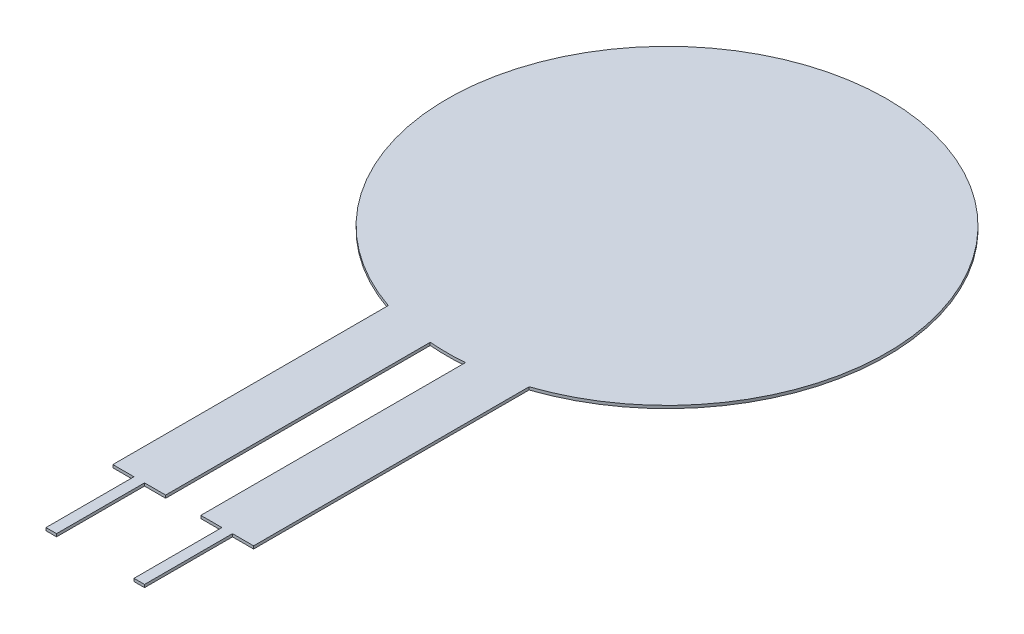
ISO-10303-21;
HEADER;
FILE_DESCRIPTION(('STEP AP214'),'2;1');
FILE_NAME('part.step','',(''),(''),'','','');
FILE_SCHEMA(('AUTOMOTIVE_DESIGN { 1 0 10303 214 1 1 1 1 }'));
ENDSEC;
DATA;
#1=APPLICATION_CONTEXT('core data for automotive mechanical design processes');
#2=APPLICATION_PROTOCOL_DEFINITION('international standard','automotive_design',2000,#1);
#3=PRODUCT_CONTEXT('',#1,'mechanical');
#4=PRODUCT('Part','Part','',(#3));
#5=PRODUCT_RELATED_PRODUCT_CATEGORY('part','',(#4));
#6=PRODUCT_DEFINITION_FORMATION('','',#4);
#7=PRODUCT_DEFINITION_CONTEXT('part definition',#1,'design');
#8=PRODUCT_DEFINITION('design','',#6,#7);
#9=PRODUCT_DEFINITION_SHAPE('','',#8);
#10=(LENGTH_UNIT() NAMED_UNIT(*) SI_UNIT(.MILLI.,.METRE.));
#11=(NAMED_UNIT(*) PLANE_ANGLE_UNIT() SI_UNIT($,.RADIAN.));
#12=(NAMED_UNIT(*) SI_UNIT($,.STERADIAN.) SOLID_ANGLE_UNIT());
#13=UNCERTAINTY_MEASURE_WITH_UNIT(LENGTH_MEASURE(1.E-05),#10,'distance_accuracy_value','');
#14=(GEOMETRIC_REPRESENTATION_CONTEXT(3) GLOBAL_UNCERTAINTY_ASSIGNED_CONTEXT((#13)) GLOBAL_UNIT_ASSIGNED_CONTEXT((#10,
#11,#12)) REPRESENTATION_CONTEXT('',''));
#15=CARTESIAN_POINT('',(0.,0.,0.));
#16=DIRECTION('',(0.,0.,1.));
#17=DIRECTION('',(1.,0.,0.));
#18=AXIS2_PLACEMENT_3D('',#15,#16,#17);
#19=CARTESIAN_POINT('',(0.,0.2032,0.));
#20=DIRECTION('',(0.,-1.,0.));
#21=DIRECTION('',(0.,0.,-1.));
#22=AXIS2_PLACEMENT_3D('',#19,#20,#21);
#23=CYLINDRICAL_SURFACE('',#22,15.875);
#24=CARTESIAN_POINT('',(0.,0.,0.));
#25=DIRECTION('',(0.,1.,0.));
#26=DIRECTION('',(0.,0.,1.));
#27=AXIS2_PLACEMENT_3D('',#24,#25,#26);
#28=CIRCLE('',#27,15.875);
#29=CARTESIAN_POINT('',(5.08,0.,15.0402534885553));
#30=VERTEX_POINT('',#29);
#31=CARTESIAN_POINT('',(-5.08000000000001,0.,15.0402534885553));
#32=VERTEX_POINT('',#31);
#33=EDGE_CURVE('E191',#30,#32,#28,.T.);
#34=ORIENTED_EDGE('',*,*,#33,.T.);
#35=DIRECTION('',(0.,-1.,0.));
#36=VECTOR('',#35,1.);
#37=CARTESIAN_POINT('',(-5.08000000000001,0.2032,15.0402534885553));
#38=LINE('',#37,#36);
#39=CARTESIAN_POINT('',(-5.08000000000001,0.2032,15.0402534885553));
#40=VERTEX_POINT('',#39);
#41=EDGE_CURVE('E53',#40,#32,#38,.T.);
#42=ORIENTED_EDGE('',*,*,#41,.F.);
#43=CARTESIAN_POINT('',(0.,0.2032,0.));
#44=DIRECTION('',(0.,1.,0.));
#45=DIRECTION('',(0.,0.,1.));
#46=AXIS2_PLACEMENT_3D('',#43,#44,#45);
#47=CIRCLE('',#46,15.875);
#48=CARTESIAN_POINT('',(5.08,0.2032,15.0402534885553));
#49=VERTEX_POINT('',#48);
#50=EDGE_CURVE('E125',#49,#40,#47,.T.);
#51=ORIENTED_EDGE('',*,*,#50,.F.);
#52=DIRECTION('',(0.,-1.,0.));
#53=VECTOR('',#52,1.);
#54=CARTESIAN_POINT('',(5.08,0.2032,15.0402534885553));
#55=LINE('',#54,#53);
#56=EDGE_CURVE('E11',#49,#30,#55,.T.);
#57=ORIENTED_EDGE('',*,*,#56,.T.);
#58=EDGE_LOOP('',(#34,#42,#51,#57));
#59=FACE_BOUND('',#58,.T.);
#60=ADVANCED_FACE('F45',(#59),#23,.T.);
#61=CARTESIAN_POINT('',(-5.08,0.2032,15.2942534885553));
#62=DIRECTION('',(1.,0.,0.));
#63=DIRECTION('',(0.,0.,-1.));
#64=AXIS2_PLACEMENT_3D('',#61,#62,#63);
#65=PLANE('',#64);
#66=DIRECTION('',(0.,0.,1.));
#67=VECTOR('',#66,1.);
#68=CARTESIAN_POINT('',(-5.08,0.,15.2942534885553));
#69=LINE('',#68,#67);
#70=CARTESIAN_POINT('',(-5.08,0.,34.925));
#71=VERTEX_POINT('',#70);
#72=EDGE_CURVE('E194',#32,#71,#69,.T.);
#73=ORIENTED_EDGE('',*,*,#72,.T.);
#74=DIRECTION('',(0.,-1.,0.));
#75=VECTOR('',#74,1.);
#76=CARTESIAN_POINT('',(-5.08,0.2032,34.925));
#77=LINE('',#76,#75);
#78=CARTESIAN_POINT('',(-5.08,0.2032,34.925));
#79=VERTEX_POINT('',#78);
#80=EDGE_CURVE('E255',#79,#71,#77,.T.);
#81=ORIENTED_EDGE('',*,*,#80,.F.);
#82=DIRECTION('',(0.,0.,-1.));
#83=VECTOR('',#82,1.);
#84=CARTESIAN_POINT('',(-5.08,0.2032,15.2942534885553));
#85=LINE('',#84,#83);
#86=EDGE_CURVE('E261',#79,#40,#85,.T.);
#87=ORIENTED_EDGE('',*,*,#86,.T.);
#88=ORIENTED_EDGE('',*,*,#41,.T.);
#89=EDGE_LOOP('',(#73,#81,#87,#88));
#90=FACE_BOUND('',#89,.T.);
#91=ADVANCED_FACE('F259',(#90),#65,.F.);
#92=CARTESIAN_POINT('',(-3.55599999999999,0.2032,34.925));
#93=DIRECTION('',(0.,0.,1.));
#94=DIRECTION('',(1.,0.,0.));
#95=AXIS2_PLACEMENT_3D('',#92,#93,#94);
#96=PLANE('',#95);
#97=DIRECTION('',(-1.,0.,0.));
#98=VECTOR('',#97,1.);
#99=CARTESIAN_POINT('',(-3.55599999999999,0.,34.925));
#100=LINE('',#99,#98);
#101=CARTESIAN_POINT('',(-3.55599999999999,0.,34.925));
#102=VERTEX_POINT('',#101);
#103=EDGE_CURVE('E197',#102,#71,#100,.T.);
#104=ORIENTED_EDGE('',*,*,#103,.F.);
#105=DIRECTION('',(0.,-1.,0.));
#106=VECTOR('',#105,1.);
#107=CARTESIAN_POINT('',(-3.55599999999999,0.2032,34.925));
#108=LINE('',#107,#106);
#109=CARTESIAN_POINT('',(-3.55599999999999,0.2032,34.925));
#110=VERTEX_POINT('',#109);
#111=EDGE_CURVE('E253',#110,#102,#108,.T.);
#112=ORIENTED_EDGE('',*,*,#111,.F.);
#113=DIRECTION('',(-1.,0.,0.));
#114=VECTOR('',#113,1.);
#115=CARTESIAN_POINT('',(-3.55599999999999,0.2032,34.925));
#116=LINE('',#115,#114);
#117=EDGE_CURVE('E273',#110,#79,#116,.T.);
#118=ORIENTED_EDGE('',*,*,#117,.T.);
#119=ORIENTED_EDGE('',*,*,#80,.T.);
#120=EDGE_LOOP('',(#104,#112,#118,#119));
#121=FACE_BOUND('',#120,.T.);
#122=ADVANCED_FACE('F269',(#121),#96,.T.);
#123=CARTESIAN_POINT('',(-3.55599999999999,0.2032,34.925));
#124=DIRECTION('',(1.,0.,0.));
#125=DIRECTION('',(0.,0.,-1.));
#126=AXIS2_PLACEMENT_3D('',#123,#124,#125);
#127=PLANE('',#126);
#128=DIRECTION('',(0.,0.,1.));
#129=VECTOR('',#128,1.);
#130=CARTESIAN_POINT('',(-3.55599999999999,0.,34.925));
#131=LINE('',#130,#129);
#132=CARTESIAN_POINT('',(-3.55599999999999,0.,41.275));
#133=VERTEX_POINT('',#132);
#134=EDGE_CURVE('E200',#102,#133,#131,.T.);
#135=ORIENTED_EDGE('',*,*,#134,.T.);
#136=DIRECTION('',(0.,-1.,0.));
#137=VECTOR('',#136,1.);
#138=CARTESIAN_POINT('',(-3.55599999999999,0.2032,41.275));
#139=LINE('',#138,#137);
#140=CARTESIAN_POINT('',(-3.55599999999999,0.2032,41.275));
#141=VERTEX_POINT('',#140);
#142=EDGE_CURVE('E250',#141,#133,#139,.T.);
#143=ORIENTED_EDGE('',*,*,#142,.F.);
#144=DIRECTION('',(0.,0.,1.));
#145=VECTOR('',#144,1.);
#146=CARTESIAN_POINT('',(-3.55599999999999,0.2032,34.925));
#147=LINE('',#146,#145);
#148=EDGE_CURVE('E274',#110,#141,#147,.T.);
#149=ORIENTED_EDGE('',*,*,#148,.F.);
#150=ORIENTED_EDGE('',*,*,#111,.T.);
#151=EDGE_LOOP('',(#135,#143,#149,#150));
#152=FACE_BOUND('',#151,.T.);
#153=ADVANCED_FACE('F325',(#152),#127,.F.);
#154=CARTESIAN_POINT('',(-3.55599999999999,0.2032,41.275));
#155=DIRECTION('',(0.,0.,-1.));
#156=DIRECTION('',(-1.,0.,0.));
#157=AXIS2_PLACEMENT_3D('',#154,#155,#156);
#158=PLANE('',#157);
#159=DIRECTION('',(1.,0.,0.));
#160=VECTOR('',#159,1.);
#161=CARTESIAN_POINT('',(-3.55599999999999,0.,41.275));
#162=LINE('',#161,#160);
#163=CARTESIAN_POINT('',(-2.79399999999999,0.,41.275));
#164=VERTEX_POINT('',#163);
#165=EDGE_CURVE('E202',#133,#164,#162,.T.);
#166=ORIENTED_EDGE('',*,*,#165,.T.);
#167=DIRECTION('',(0.,-1.,0.));
#168=VECTOR('',#167,1.);
#169=CARTESIAN_POINT('',(-2.79399999999999,0.2032,41.275));
#170=LINE('',#169,#168);
#171=CARTESIAN_POINT('',(-2.79399999999999,0.2032,41.275));
#172=VERTEX_POINT('',#171);
#173=EDGE_CURVE('E248',#172,#164,#170,.T.);
#174=ORIENTED_EDGE('',*,*,#173,.F.);
#175=DIRECTION('',(1.,0.,0.));
#176=VECTOR('',#175,1.);
#177=CARTESIAN_POINT('',(-3.55599999999999,0.2032,41.275));
#178=LINE('',#177,#176);
#179=EDGE_CURVE('E276',#141,#172,#178,.T.);
#180=ORIENTED_EDGE('',*,*,#179,.F.);
#181=ORIENTED_EDGE('',*,*,#142,.T.);
#182=EDGE_LOOP('',(#166,#174,#180,#181));
#183=FACE_BOUND('',#182,.T.);
#184=ADVANCED_FACE('F330',(#183),#158,.F.);
#185=CARTESIAN_POINT('',(-2.79399999999999,0.2032,34.925));
#186=DIRECTION('',(1.,0.,0.));
#187=DIRECTION('',(0.,0.,-1.));
#188=AXIS2_PLACEMENT_3D('',#185,#186,#187);
#189=PLANE('',#188);
#190=DIRECTION('',(0.,0.,1.));
#191=VECTOR('',#190,1.);
#192=CARTESIAN_POINT('',(-2.79399999999999,0.,34.925));
#193=LINE('',#192,#191);
#194=CARTESIAN_POINT('',(-2.79399999999999,0.,34.925));
#195=VERTEX_POINT('',#194);
#196=EDGE_CURVE('E205',#195,#164,#193,.T.);
#197=ORIENTED_EDGE('',*,*,#196,.F.);
#198=DIRECTION('',(0.,-1.,0.));
#199=VECTOR('',#198,1.);
#200=CARTESIAN_POINT('',(-2.79399999999999,0.2032,34.925));
#201=LINE('',#200,#199);
#202=CARTESIAN_POINT('',(-2.79399999999999,0.2032,34.925));
#203=VERTEX_POINT('',#202);
#204=EDGE_CURVE('E246',#203,#195,#201,.T.);
#205=ORIENTED_EDGE('',*,*,#204,.F.);
#206=DIRECTION('',(0.,0.,1.));
#207=VECTOR('',#206,1.);
#208=CARTESIAN_POINT('',(-2.79399999999999,0.2032,34.925));
#209=LINE('',#208,#207);
#210=EDGE_CURVE('E282',#203,#172,#209,.T.);
#211=ORIENTED_EDGE('',*,*,#210,.T.);
#212=ORIENTED_EDGE('',*,*,#173,.T.);
#213=EDGE_LOOP('',(#197,#205,#211,#212));
#214=FACE_BOUND('',#213,.T.);
#215=ADVANCED_FACE('F334',(#214),#189,.T.);
#216=CARTESIAN_POINT('',(-1.27,0.2032,34.925));
#217=DIRECTION('',(0.,0.,1.));
#218=DIRECTION('',(1.,0.,0.));
#219=AXIS2_PLACEMENT_3D('',#216,#217,#218);
#220=PLANE('',#219);
#221=DIRECTION('',(-1.,0.,0.));
#222=VECTOR('',#221,1.);
#223=CARTESIAN_POINT('',(-1.27,0.,34.925));
#224=LINE('',#223,#222);
#225=CARTESIAN_POINT('',(-1.27,0.,34.925));
#226=VERTEX_POINT('',#225);
#227=EDGE_CURVE('E208',#226,#195,#224,.T.);
#228=ORIENTED_EDGE('',*,*,#227,.F.);
#229=DIRECTION('',(0.,-1.,0.));
#230=VECTOR('',#229,1.);
#231=CARTESIAN_POINT('',(-1.27,0.2032,34.925));
#232=LINE('',#231,#230);
#233=CARTESIAN_POINT('',(-1.27,0.2032,34.925));
#234=VERTEX_POINT('',#233);
#235=EDGE_CURVE('E244',#234,#226,#232,.T.);
#236=ORIENTED_EDGE('',*,*,#235,.F.);
#237=DIRECTION('',(-1.,0.,0.));
#238=VECTOR('',#237,1.);
#239=CARTESIAN_POINT('',(-1.27,0.2032,34.925));
#240=LINE('',#239,#238);
#241=EDGE_CURVE('E285',#234,#203,#240,.T.);
#242=ORIENTED_EDGE('',*,*,#241,.T.);
#243=ORIENTED_EDGE('',*,*,#204,.T.);
#244=EDGE_LOOP('',(#228,#236,#242,#243));
#245=FACE_BOUND('',#244,.T.);
#246=ADVANCED_FACE('F338',(#245),#220,.T.);
#247=CARTESIAN_POINT('',(-1.27,0.2032,15.8241184588589));
#248=DIRECTION('',(1.,0.,0.));
#249=DIRECTION('',(0.,0.,-1.));
#250=AXIS2_PLACEMENT_3D('',#247,#248,#249);
#251=PLANE('',#250);
#252=DIRECTION('',(0.,0.,1.));
#253=VECTOR('',#252,1.);
#254=CARTESIAN_POINT('',(-1.27,0.,15.8241184588589));
#255=LINE('',#254,#253);
#256=CARTESIAN_POINT('',(-1.27,0.,15.8241184588589));
#257=VERTEX_POINT('',#256);
#258=EDGE_CURVE('E211',#257,#226,#255,.T.);
#259=ORIENTED_EDGE('',*,*,#258,.F.);
#260=DIRECTION('',(0.,-1.,0.));
#261=VECTOR('',#260,1.);
#262=CARTESIAN_POINT('',(-1.27,0.2032,15.8241184588589));
#263=LINE('',#262,#261);
#264=CARTESIAN_POINT('',(-1.27,0.2032,15.8241184588589));
#265=VERTEX_POINT('',#264);
#266=EDGE_CURVE('E242',#265,#257,#263,.T.);
#267=ORIENTED_EDGE('',*,*,#266,.F.);
#268=DIRECTION('',(0.,0.,1.));
#269=VECTOR('',#268,1.);
#270=CARTESIAN_POINT('',(-1.27,0.2032,15.8241184588589));
#271=LINE('',#270,#269);
#272=EDGE_CURVE('E288',#265,#234,#271,.T.);
#273=ORIENTED_EDGE('',*,*,#272,.T.);
#274=ORIENTED_EDGE('',*,*,#235,.T.);
#275=EDGE_LOOP('',(#259,#267,#273,#274));
#276=FACE_BOUND('',#275,.T.);
#277=ADVANCED_FACE('F342',(#276),#251,.T.);
#278=CARTESIAN_POINT('',(0.,0.2032,0.));
#279=DIRECTION('',(0.,-1.,0.));
#280=DIRECTION('',(0.,0.,-1.));
#281=AXIS2_PLACEMENT_3D('',#278,#279,#280);
#282=CYLINDRICAL_SURFACE('',#281,15.875);
#283=CARTESIAN_POINT('',(0.,0.,0.));
#284=DIRECTION('',(0.,1.,0.));
#285=DIRECTION('',(0.,0.,1.));
#286=AXIS2_PLACEMENT_3D('',#283,#284,#285);
#287=CIRCLE('',#286,15.875);
#288=CARTESIAN_POINT('',(1.27,0.,15.8241184588589));
#289=VERTEX_POINT('',#288);
#290=EDGE_CURVE('E214',#257,#289,#287,.T.);
#291=ORIENTED_EDGE('',*,*,#290,.T.);
#292=DIRECTION('',(0.,-1.,0.));
#293=VECTOR('',#292,1.);
#294=CARTESIAN_POINT('',(1.27,0.2032,15.8241184588589));
#295=LINE('',#294,#293);
#296=CARTESIAN_POINT('',(1.27,0.2032,15.8241184588589));
#297=VERTEX_POINT('',#296);
#298=EDGE_CURVE('E239',#297,#289,#295,.T.);
#299=ORIENTED_EDGE('',*,*,#298,.F.);
#300=CARTESIAN_POINT('',(0.,0.2032,0.));
#301=DIRECTION('',(0.,1.,0.));
#302=DIRECTION('',(0.,0.,1.));
#303=AXIS2_PLACEMENT_3D('',#300,#301,#302);
#304=CIRCLE('',#303,15.875);
#305=EDGE_CURVE('E291',#265,#297,#304,.T.);
#306=ORIENTED_EDGE('',*,*,#305,.F.);
#307=ORIENTED_EDGE('',*,*,#266,.T.);
#308=EDGE_LOOP('',(#291,#299,#306,#307));
#309=FACE_BOUND('',#308,.T.);
#310=ADVANCED_FACE('F346',(#309),#282,.T.);
#311=CARTESIAN_POINT('',(1.27,0.2032,15.8241184588589));
#312=DIRECTION('',(1.,0.,0.));
#313=DIRECTION('',(0.,0.,-1.));
#314=AXIS2_PLACEMENT_3D('',#311,#312,#313);
#315=PLANE('',#314);
#316=DIRECTION('',(0.,0.,1.));
#317=VECTOR('',#316,1.);
#318=CARTESIAN_POINT('',(1.27,0.,15.8241184588589));
#319=LINE('',#318,#317);
#320=CARTESIAN_POINT('',(1.27,0.,34.925));
#321=VERTEX_POINT('',#320);
#322=EDGE_CURVE('E216',#289,#321,#319,.T.);
#323=ORIENTED_EDGE('',*,*,#322,.T.);
#324=DIRECTION('',(0.,-1.,0.));
#325=VECTOR('',#324,1.);
#326=CARTESIAN_POINT('',(1.27,0.2032,34.925));
#327=LINE('',#326,#325);
#328=CARTESIAN_POINT('',(1.27,0.2032,34.925));
#329=VERTEX_POINT('',#328);
#330=EDGE_CURVE('E236',#329,#321,#327,.T.);
#331=ORIENTED_EDGE('',*,*,#330,.F.);
#332=DIRECTION('',(0.,0.,1.));
#333=VECTOR('',#332,1.);
#334=CARTESIAN_POINT('',(1.27,0.2032,15.8241184588589));
#335=LINE('',#334,#333);
#336=EDGE_CURVE('E293',#297,#329,#335,.T.);
#337=ORIENTED_EDGE('',*,*,#336,.F.);
#338=ORIENTED_EDGE('',*,*,#298,.T.);
#339=EDGE_LOOP('',(#323,#331,#337,#338));
#340=FACE_BOUND('',#339,.T.);
#341=ADVANCED_FACE('F350',(#340),#315,.F.);
#342=CARTESIAN_POINT('',(1.27,0.2032,34.925));
#343=DIRECTION('',(0.,0.,-1.));
#344=DIRECTION('',(-1.,0.,0.));
#345=AXIS2_PLACEMENT_3D('',#342,#343,#344);
#346=PLANE('',#345);
#347=DIRECTION('',(1.,0.,0.));
#348=VECTOR('',#347,1.);
#349=CARTESIAN_POINT('',(1.27,0.,34.925));
#350=LINE('',#349,#348);
#351=CARTESIAN_POINT('',(2.79400000000001,0.,34.925));
#352=VERTEX_POINT('',#351);
#353=EDGE_CURVE('E218',#321,#352,#350,.T.);
#354=ORIENTED_EDGE('',*,*,#353,.T.);
#355=DIRECTION('',(0.,-1.,0.));
#356=VECTOR('',#355,1.);
#357=CARTESIAN_POINT('',(2.79400000000001,0.2032,34.925));
#358=LINE('',#357,#356);
#359=CARTESIAN_POINT('',(2.79400000000001,0.2032,34.925));
#360=VERTEX_POINT('',#359);
#361=EDGE_CURVE('E233',#360,#352,#358,.T.);
#362=ORIENTED_EDGE('',*,*,#361,.F.);
#363=DIRECTION('',(1.,0.,0.));
#364=VECTOR('',#363,1.);
#365=CARTESIAN_POINT('',(1.27,0.2032,34.925));
#366=LINE('',#365,#364);
#367=EDGE_CURVE('E295',#329,#360,#366,.T.);
#368=ORIENTED_EDGE('',*,*,#367,.F.);
#369=ORIENTED_EDGE('',*,*,#330,.T.);
#370=EDGE_LOOP('',(#354,#362,#368,#369));
#371=FACE_BOUND('',#370,.T.);
#372=ADVANCED_FACE('F301',(#371),#346,.F.);
#373=CARTESIAN_POINT('',(2.79400000000001,0.2032,34.925));
#374=DIRECTION('',(1.,0.,0.));
#375=DIRECTION('',(0.,0.,-1.));
#376=AXIS2_PLACEMENT_3D('',#373,#374,#375);
#377=PLANE('',#376);
#378=DIRECTION('',(0.,0.,1.));
#379=VECTOR('',#378,1.);
#380=CARTESIAN_POINT('',(2.79400000000001,0.,34.925));
#381=LINE('',#380,#379);
#382=CARTESIAN_POINT('',(2.79400000000001,0.,41.275));
#383=VERTEX_POINT('',#382);
#384=EDGE_CURVE('E220',#352,#383,#381,.T.);
#385=ORIENTED_EDGE('',*,*,#384,.T.);
#386=DIRECTION('',(0.,-1.,0.));
#387=VECTOR('',#386,1.);
#388=CARTESIAN_POINT('',(2.79400000000001,0.2032,41.275));
#389=LINE('',#388,#387);
#390=CARTESIAN_POINT('',(2.79400000000001,0.2032,41.275));
#391=VERTEX_POINT('',#390);
#392=EDGE_CURVE('E183',#391,#383,#389,.T.);
#393=ORIENTED_EDGE('',*,*,#392,.F.);
#394=DIRECTION('',(0.,0.,1.));
#395=VECTOR('',#394,1.);
#396=CARTESIAN_POINT('',(2.79400000000001,0.2032,34.925));
#397=LINE('',#396,#395);
#398=EDGE_CURVE('E170',#360,#391,#397,.T.);
#399=ORIENTED_EDGE('',*,*,#398,.F.);
#400=ORIENTED_EDGE('',*,*,#361,.T.);
#401=EDGE_LOOP('',(#385,#393,#399,#400));
#402=FACE_BOUND('',#401,.T.);
#403=ADVANCED_FACE('F305',(#402),#377,.F.);
#404=CARTESIAN_POINT('',(2.79400000000001,0.2032,41.275));
#405=DIRECTION('',(0.,0.,-1.));
#406=DIRECTION('',(-1.,0.,0.));
#407=AXIS2_PLACEMENT_3D('',#404,#405,#406);
#408=PLANE('',#407);
#409=DIRECTION('',(1.,0.,0.));
#410=VECTOR('',#409,1.);
#411=CARTESIAN_POINT('',(2.79400000000001,0.,41.275));
#412=LINE('',#411,#410);
#413=CARTESIAN_POINT('',(3.55600000000001,0.,41.275));
#414=VERTEX_POINT('',#413);
#415=EDGE_CURVE('E179',#383,#414,#412,.T.);
#416=ORIENTED_EDGE('',*,*,#415,.T.);
#417=DIRECTION('',(0.,-1.,0.));
#418=VECTOR('',#417,1.);
#419=CARTESIAN_POINT('',(3.55600000000001,0.2032,41.275));
#420=LINE('',#419,#418);
#421=CARTESIAN_POINT('',(3.55600000000001,0.2032,41.275));
#422=VERTEX_POINT('',#421);
#423=EDGE_CURVE('E176',#422,#414,#420,.T.);
#424=ORIENTED_EDGE('',*,*,#423,.F.);
#425=DIRECTION('',(1.,0.,0.));
#426=VECTOR('',#425,1.);
#427=CARTESIAN_POINT('',(2.79400000000001,0.2032,41.275));
#428=LINE('',#427,#426);
#429=EDGE_CURVE('E164',#391,#422,#428,.T.);
#430=ORIENTED_EDGE('',*,*,#429,.F.);
#431=ORIENTED_EDGE('',*,*,#392,.T.);
#432=EDGE_LOOP('',(#416,#424,#430,#431));
#433=FACE_BOUND('',#432,.T.);
#434=ADVANCED_FACE('F177',(#433),#408,.F.);
#435=CARTESIAN_POINT('',(3.55600000000001,0.2032,34.925));
#436=DIRECTION('',(1.,0.,0.));
#437=DIRECTION('',(0.,0.,-1.));
#438=AXIS2_PLACEMENT_3D('',#435,#436,#437);
#439=PLANE('',#438);
#440=DIRECTION('',(0.,0.,1.));
#441=VECTOR('',#440,1.);
#442=CARTESIAN_POINT('',(3.55600000000001,0.,34.925));
#443=LINE('',#442,#441);
#444=CARTESIAN_POINT('',(3.55600000000001,0.,34.925));
#445=VERTEX_POINT('',#444);
#446=EDGE_CURVE('E223',#445,#414,#443,.T.);
#447=ORIENTED_EDGE('',*,*,#446,.F.);
#448=DIRECTION('',(0.,-1.,0.));
#449=VECTOR('',#448,1.);
#450=CARTESIAN_POINT('',(3.55600000000001,0.2032,34.925));
#451=LINE('',#450,#449);
#452=CARTESIAN_POINT('',(3.55600000000001,0.2032,34.925));
#453=VERTEX_POINT('',#452);
#454=EDGE_CURVE('E114',#453,#445,#451,.T.);
#455=ORIENTED_EDGE('',*,*,#454,.F.);
#456=DIRECTION('',(0.,0.,1.));
#457=VECTOR('',#456,1.);
#458=CARTESIAN_POINT('',(3.55600000000001,0.2032,34.925));
#459=LINE('',#458,#457);
#460=EDGE_CURVE('E168',#453,#422,#459,.T.);
#461=ORIENTED_EDGE('',*,*,#460,.T.);
#462=ORIENTED_EDGE('',*,*,#423,.T.);
#463=EDGE_LOOP('',(#447,#455,#461,#462));
#464=FACE_BOUND('',#463,.T.);
#465=ADVANCED_FACE('F185',(#464),#439,.T.);
#466=CARTESIAN_POINT('',(3.55600000000001,0.2032,34.925));
#467=DIRECTION('',(0.,0.,-1.));
#468=DIRECTION('',(-1.,0.,0.));
#469=AXIS2_PLACEMENT_3D('',#466,#467,#468);
#470=PLANE('',#469);
#471=DIRECTION('',(1.,0.,0.));
#472=VECTOR('',#471,1.);
#473=CARTESIAN_POINT('',(3.55600000000001,0.,34.925));
#474=LINE('',#473,#472);
#475=CARTESIAN_POINT('',(5.08,0.,34.925));
#476=VERTEX_POINT('',#475);
#477=EDGE_CURVE('E225',#445,#476,#474,.T.);
#478=ORIENTED_EDGE('',*,*,#477,.T.);
#479=DIRECTION('',(0.,-1.,0.));
#480=VECTOR('',#479,1.);
#481=CARTESIAN_POINT('',(5.08,0.2032,34.925));
#482=LINE('',#481,#480);
#483=CARTESIAN_POINT('',(5.08,0.2032,34.925));
#484=VERTEX_POINT('',#483);
#485=EDGE_CURVE('E118',#484,#476,#482,.T.);
#486=ORIENTED_EDGE('',*,*,#485,.F.);
#487=DIRECTION('',(1.,0.,0.));
#488=VECTOR('',#487,1.);
#489=CARTESIAN_POINT('',(3.55600000000001,0.2032,34.925));
#490=LINE('',#489,#488);
#491=EDGE_CURVE('E186',#453,#484,#490,.T.);
#492=ORIENTED_EDGE('',*,*,#491,.F.);
#493=ORIENTED_EDGE('',*,*,#454,.T.);
#494=EDGE_LOOP('',(#478,#486,#492,#493));
#495=FACE_BOUND('',#494,.T.);
#496=ADVANCED_FACE('F306',(#495),#470,.F.);
#497=CARTESIAN_POINT('',(5.08,0.2032,15.2942534885553));
#498=DIRECTION('',(1.,0.,0.));
#499=DIRECTION('',(0.,0.,-1.));
#500=AXIS2_PLACEMENT_3D('',#497,#498,#499);
#501=PLANE('',#500);
#502=DIRECTION('',(0.,0.,1.));
#503=VECTOR('',#502,1.);
#504=CARTESIAN_POINT('',(5.08,0.,15.2942534885553));
#505=LINE('',#504,#503);
#506=EDGE_CURVE('E227',#30,#476,#505,.T.);
#507=ORIENTED_EDGE('',*,*,#506,.F.);
#508=ORIENTED_EDGE('',*,*,#56,.F.);
#509=DIRECTION('',(0.,0.,-1.));
#510=VECTOR('',#509,1.);
#511=CARTESIAN_POINT('',(5.08,0.2032,15.2942534885553));
#512=LINE('',#511,#510);
#513=EDGE_CURVE('E61',#484,#49,#512,.T.);
#514=ORIENTED_EDGE('',*,*,#513,.F.);
#515=ORIENTED_EDGE('',*,*,#485,.T.);
#516=EDGE_LOOP('',(#507,#508,#514,#515));
#517=FACE_BOUND('',#516,.T.);
#518=ADVANCED_FACE('F308',(#517),#501,.T.);
#519=CARTESIAN_POINT('',(0.,0.2032,0.));
#520=DIRECTION('',(0.,1.,0.));
#521=DIRECTION('',(0.,0.,1.));
#522=AXIS2_PLACEMENT_3D('',#519,#520,#521);
#523=PLANE('',#522);
#524=ORIENTED_EDGE('',*,*,#513,.T.);
#525=ORIENTED_EDGE('',*,*,#50,.T.);
#526=ORIENTED_EDGE('',*,*,#86,.F.);
#527=ORIENTED_EDGE('',*,*,#117,.F.);
#528=ORIENTED_EDGE('',*,*,#148,.T.);
#529=ORIENTED_EDGE('',*,*,#179,.T.);
#530=ORIENTED_EDGE('',*,*,#210,.F.);
#531=ORIENTED_EDGE('',*,*,#241,.F.);
#532=ORIENTED_EDGE('',*,*,#272,.F.);
#533=ORIENTED_EDGE('',*,*,#305,.T.);
#534=ORIENTED_EDGE('',*,*,#336,.T.);
#535=ORIENTED_EDGE('',*,*,#367,.T.);
#536=ORIENTED_EDGE('',*,*,#398,.T.);
#537=ORIENTED_EDGE('',*,*,#429,.T.);
#538=ORIENTED_EDGE('',*,*,#460,.F.);
#539=ORIENTED_EDGE('',*,*,#491,.T.);
#540=EDGE_LOOP('',(#524,#525,#526,#527,#528,#529,#530,#531,#532,#533,#534,#535,#536,#537,#538,#539));
#541=FACE_BOUND('',#540,.T.);
#542=ADVANCED_FACE('F166',(#541),#523,.T.);
#543=CARTESIAN_POINT('',(0.,0.,0.));
#544=DIRECTION('',(0.,1.,0.));
#545=DIRECTION('',(0.,0.,1.));
#546=AXIS2_PLACEMENT_3D('',#543,#544,#545);
#547=PLANE('',#546);
#548=ORIENTED_EDGE('',*,*,#33,.F.);
#549=ORIENTED_EDGE('',*,*,#506,.T.);
#550=ORIENTED_EDGE('',*,*,#477,.F.);
#551=ORIENTED_EDGE('',*,*,#446,.T.);
#552=ORIENTED_EDGE('',*,*,#415,.F.);
#553=ORIENTED_EDGE('',*,*,#384,.F.);
#554=ORIENTED_EDGE('',*,*,#353,.F.);
#555=ORIENTED_EDGE('',*,*,#322,.F.);
#556=ORIENTED_EDGE('',*,*,#290,.F.);
#557=ORIENTED_EDGE('',*,*,#258,.T.);
#558=ORIENTED_EDGE('',*,*,#227,.T.);
#559=ORIENTED_EDGE('',*,*,#196,.T.);
#560=ORIENTED_EDGE('',*,*,#165,.F.);
#561=ORIENTED_EDGE('',*,*,#134,.F.);
#562=ORIENTED_EDGE('',*,*,#103,.T.);
#563=ORIENTED_EDGE('',*,*,#72,.F.);
#564=EDGE_LOOP('',(#548,#549,#550,#551,#552,#553,#554,#555,#556,#557,#558,#559,#560,#561,#562,#563));
#565=FACE_BOUND('',#564,.T.);
#566=ADVANCED_FACE('F264',(#565),#547,.F.);
#567=CLOSED_SHELL('',(#60,#91,#122,#153,#184,#215,#246,#277,#310,#341,#372,#403,#434,#465,#496,
#518,#542,#566));
#568=MANIFOLD_SOLID_BREP('B2',#567);
#569=ADVANCED_BREP_SHAPE_REPRESENTATION('',(#18,#568),#14);
#570=SHAPE_DEFINITION_REPRESENTATION(#9,#569);
ENDSEC;
END-ISO-10303-21;
